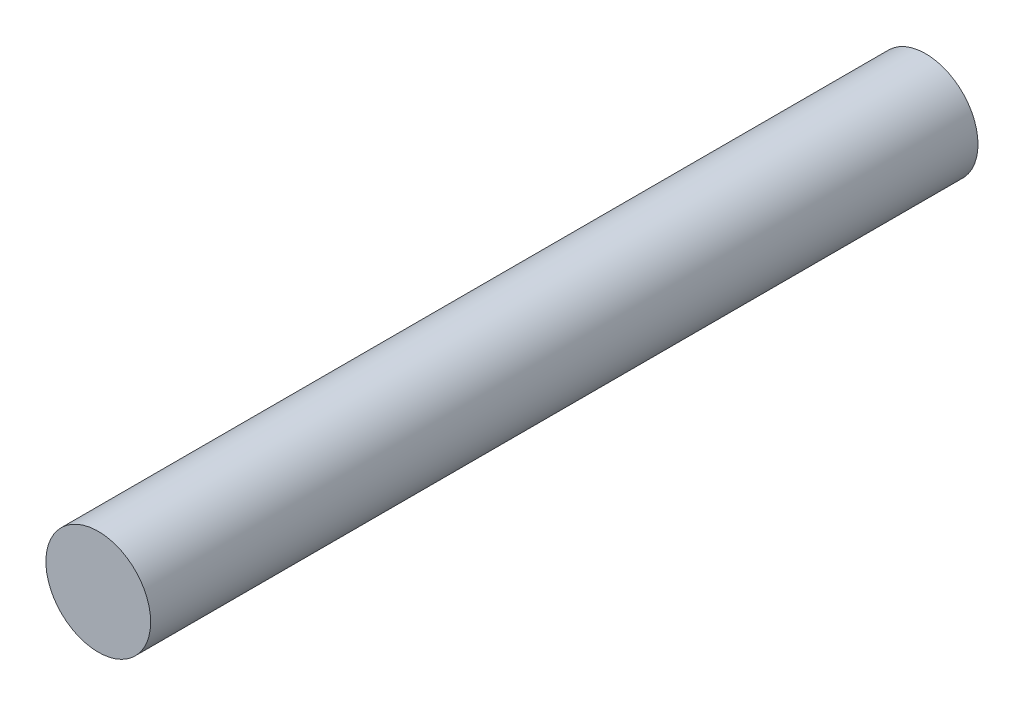
ISO-10303-21;
HEADER;
FILE_DESCRIPTION(('STEP AP214'),'2;1');
FILE_NAME('part.step','',(''),(''),'','','');
FILE_SCHEMA(('AUTOMOTIVE_DESIGN { 1 0 10303 214 1 1 1 1 }'));
ENDSEC;
DATA;
#1=APPLICATION_CONTEXT('core data for automotive mechanical design processes');
#2=APPLICATION_PROTOCOL_DEFINITION('international standard','automotive_design',2000,#1);
#3=PRODUCT_CONTEXT('',#1,'mechanical');
#4=PRODUCT('Part','Part','',(#3));
#5=PRODUCT_RELATED_PRODUCT_CATEGORY('part','',(#4));
#6=PRODUCT_DEFINITION_FORMATION('','',#4);
#7=PRODUCT_DEFINITION_CONTEXT('part definition',#1,'design');
#8=PRODUCT_DEFINITION('design','',#6,#7);
#9=PRODUCT_DEFINITION_SHAPE('','',#8);
#10=(LENGTH_UNIT() NAMED_UNIT(*) SI_UNIT(.MILLI.,.METRE.));
#11=(NAMED_UNIT(*) PLANE_ANGLE_UNIT() SI_UNIT($,.RADIAN.));
#12=(NAMED_UNIT(*) SI_UNIT($,.STERADIAN.) SOLID_ANGLE_UNIT());
#13=UNCERTAINTY_MEASURE_WITH_UNIT(LENGTH_MEASURE(1.E-05),#10,'distance_accuracy_value','');
#14=(GEOMETRIC_REPRESENTATION_CONTEXT(3) GLOBAL_UNCERTAINTY_ASSIGNED_CONTEXT((#13)) GLOBAL_UNIT_ASSIGNED_CONTEXT((#10,
#11,#12)) REPRESENTATION_CONTEXT('',''));
#15=CARTESIAN_POINT('',(0.,0.,0.));
#16=DIRECTION('',(0.,0.,1.));
#17=DIRECTION('',(1.,0.,0.));
#18=AXIS2_PLACEMENT_3D('',#15,#16,#17);
#19=CARTESIAN_POINT('',(0.,0.,15.8));
#20=DIRECTION('',(0.,0.,-1.));
#21=DIRECTION('',(-1.,0.,0.));
#22=AXIS2_PLACEMENT_3D('',#19,#20,#21);
#23=CYLINDRICAL_SURFACE('',#22,2.);
#24=CARTESIAN_POINT('',(0.,0.,15.8));
#25=DIRECTION('',(0.,0.,1.));
#26=DIRECTION('',(1.,0.,0.));
#27=AXIS2_PLACEMENT_3D('',#24,#25,#26);
#28=CIRCLE('',#27,2.);
#29=CARTESIAN_POINT('',(2.,0.,15.8));
#30=VERTEX_POINT('',#29);
#31=EDGE_CURVE('E10',#30,#30,#28,.T.);
#32=ORIENTED_EDGE('',*,*,#31,.F.);
#33=EDGE_LOOP('',(#32));
#34=FACE_BOUND('',#33,.T.);
#35=CARTESIAN_POINT('',(0.,0.,-15.8));
#36=DIRECTION('',(0.,0.,1.));
#37=DIRECTION('',(1.,0.,0.));
#38=AXIS2_PLACEMENT_3D('',#35,#36,#37);
#39=CIRCLE('',#38,2.);
#40=CARTESIAN_POINT('',(2.,0.,-15.8));
#41=VERTEX_POINT('',#40);
#42=EDGE_CURVE('E33',#41,#41,#39,.T.);
#43=ORIENTED_EDGE('',*,*,#42,.T.);
#44=EDGE_LOOP('',(#43));
#45=FACE_BOUND('',#44,.T.);
#46=ADVANCED_FACE('F30',(#34,#45),#23,.T.);
#47=CARTESIAN_POINT('',(0.,0.,15.8));
#48=DIRECTION('',(0.,0.,1.));
#49=DIRECTION('',(1.,0.,0.));
#50=AXIS2_PLACEMENT_3D('',#47,#48,#49);
#51=PLANE('',#50);
#52=ORIENTED_EDGE('',*,*,#31,.T.);
#53=EDGE_LOOP('',(#52));
#54=FACE_BOUND('',#53,.T.);
#55=ADVANCED_FACE('F45',(#54),#51,.T.);
#56=CARTESIAN_POINT('',(0.,0.,-15.8));
#57=DIRECTION('',(0.,0.,1.));
#58=DIRECTION('',(1.,0.,0.));
#59=AXIS2_PLACEMENT_3D('',#56,#57,#58);
#60=PLANE('',#59);
#61=ORIENTED_EDGE('',*,*,#42,.F.);
#62=EDGE_LOOP('',(#61));
#63=FACE_BOUND('',#62,.T.);
#64=ADVANCED_FACE('F43',(#63),#60,.F.);
#65=CLOSED_SHELL('',(#46,#55,#64));
#66=MANIFOLD_SOLID_BREP('B2',#65);
#67=ADVANCED_BREP_SHAPE_REPRESENTATION('',(#18,#66),#14);
#68=SHAPE_DEFINITION_REPRESENTATION(#9,#67);
ENDSEC;
END-ISO-10303-21;
